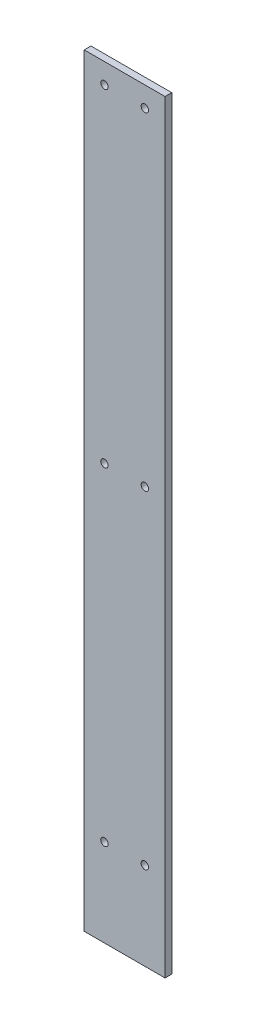
ISO-10303-21;
HEADER;
FILE_DESCRIPTION(('STEP AP214'),'2;1');
FILE_NAME('part.step','',(''),(''),'','','');
FILE_SCHEMA(('AUTOMOTIVE_DESIGN { 1 0 10303 214 1 1 1 1 }'));
ENDSEC;
DATA;
#1=APPLICATION_CONTEXT('core data for automotive mechanical design processes');
#2=APPLICATION_PROTOCOL_DEFINITION('international standard','automotive_design',2000,#1);
#3=PRODUCT_CONTEXT('',#1,'mechanical');
#4=PRODUCT('Part','Part','',(#3));
#5=PRODUCT_RELATED_PRODUCT_CATEGORY('part','',(#4));
#6=PRODUCT_DEFINITION_FORMATION('','',#4);
#7=PRODUCT_DEFINITION_CONTEXT('part definition',#1,'design');
#8=PRODUCT_DEFINITION('design','',#6,#7);
#9=PRODUCT_DEFINITION_SHAPE('','',#8);
#10=(LENGTH_UNIT() NAMED_UNIT(*) SI_UNIT(.MILLI.,.METRE.));
#11=(NAMED_UNIT(*) PLANE_ANGLE_UNIT() SI_UNIT($,.RADIAN.));
#12=(NAMED_UNIT(*) SI_UNIT($,.STERADIAN.) SOLID_ANGLE_UNIT());
#13=UNCERTAINTY_MEASURE_WITH_UNIT(LENGTH_MEASURE(1.E-05),#10,'distance_accuracy_value','');
#14=(GEOMETRIC_REPRESENTATION_CONTEXT(3) GLOBAL_UNCERTAINTY_ASSIGNED_CONTEXT((#13)) GLOBAL_UNIT_ASSIGNED_CONTEXT((#10,
#11,#12)) REPRESENTATION_CONTEXT('',''));
#15=CARTESIAN_POINT('',(0.,0.,0.));
#16=DIRECTION('',(0.,0.,1.));
#17=DIRECTION('',(1.,0.,0.));
#18=AXIS2_PLACEMENT_3D('',#15,#16,#17);
#19=CARTESIAN_POINT('',(0.,0.,5.));
#20=DIRECTION('',(0.,0.,-1.));
#21=DIRECTION('',(-1.,0.,0.));
#22=AXIS2_PLACEMENT_3D('',#19,#20,#21);
#23=PLANE('',#22);
#24=DIRECTION('',(0.,-1.,0.));
#25=VECTOR('',#24,1.);
#26=CARTESIAN_POINT('',(0.,0.,5.));
#27=LINE('',#26,#25);
#28=CARTESIAN_POINT('',(0.,567.,5.));
#29=VERTEX_POINT('',#28);
#30=CARTESIAN_POINT('',(0.,0.,5.));
#31=VERTEX_POINT('',#30);
#32=EDGE_CURVE('E88',#29,#31,#27,.T.);
#33=ORIENTED_EDGE('',*,*,#32,.T.);
#34=DIRECTION('',(1.,0.,0.));
#35=VECTOR('',#34,1.);
#36=CARTESIAN_POINT('',(0.,0.,5.));
#37=LINE('',#36,#35);
#38=CARTESIAN_POINT('',(60.,0.,5.));
#39=VERTEX_POINT('',#38);
#40=EDGE_CURVE('E83',#31,#39,#37,.T.);
#41=ORIENTED_EDGE('',*,*,#40,.T.);
#42=DIRECTION('',(0.,1.,0.));
#43=VECTOR('',#42,1.);
#44=CARTESIAN_POINT('',(60.,0.,5.));
#45=LINE('',#44,#43);
#46=CARTESIAN_POINT('',(60.,567.,5.));
#47=VERTEX_POINT('',#46);
#48=EDGE_CURVE('E86',#39,#47,#45,.T.);
#49=ORIENTED_EDGE('',*,*,#48,.T.);
#50=DIRECTION('',(-1.,0.,0.));
#51=VECTOR('',#50,1.);
#52=CARTESIAN_POINT('',(0.,567.,5.));
#53=LINE('',#52,#51);
#54=EDGE_CURVE('E53',#47,#29,#53,.T.);
#55=ORIENTED_EDGE('',*,*,#54,.T.);
#56=EDGE_LOOP('',(#33,#41,#49,#55));
#57=FACE_BOUND('',#56,.T.);
#58=CARTESIAN_POINT('',(15.,552.,5.));
#59=DIRECTION('',(0.,0.,1.));
#60=DIRECTION('',(1.,0.,0.));
#61=AXIS2_PLACEMENT_3D('',#58,#59,#60);
#62=CIRCLE('',#61,2.74999999999998);
#63=CARTESIAN_POINT('',(17.75,552.,5.));
#64=VERTEX_POINT('',#63);
#65=EDGE_CURVE('E103',#64,#64,#62,.T.);
#66=ORIENTED_EDGE('',*,*,#65,.F.);
#67=EDGE_LOOP('',(#66));
#68=FACE_BOUND('',#67,.T.);
#69=CARTESIAN_POINT('',(45.,552.,5.));
#70=DIRECTION('',(0.,0.,1.));
#71=DIRECTION('',(1.,0.,0.));
#72=AXIS2_PLACEMENT_3D('',#69,#70,#71);
#73=CIRCLE('',#72,2.74999999999999);
#74=CARTESIAN_POINT('',(47.75,552.,5.));
#75=VERTEX_POINT('',#74);
#76=EDGE_CURVE('E118',#75,#75,#73,.T.);
#77=ORIENTED_EDGE('',*,*,#76,.F.);
#78=EDGE_LOOP('',(#77));
#79=FACE_BOUND('',#78,.T.);
#80=CARTESIAN_POINT('',(45.,308.5,5.));
#81=DIRECTION('',(0.,0.,1.));
#82=DIRECTION('',(1.,0.,0.));
#83=AXIS2_PLACEMENT_3D('',#80,#81,#82);
#84=CIRCLE('',#83,2.75);
#85=CARTESIAN_POINT('',(47.75,308.5,5.));
#86=VERTEX_POINT('',#85);
#87=EDGE_CURVE('E124',#86,#86,#84,.T.);
#88=ORIENTED_EDGE('',*,*,#87,.F.);
#89=EDGE_LOOP('',(#88));
#90=FACE_BOUND('',#89,.T.);
#91=CARTESIAN_POINT('',(15.,308.5,5.));
#92=DIRECTION('',(0.,0.,1.));
#93=DIRECTION('',(1.,0.,0.));
#94=AXIS2_PLACEMENT_3D('',#91,#92,#93);
#95=CIRCLE('',#94,2.75);
#96=CARTESIAN_POINT('',(17.75,308.5,5.));
#97=VERTEX_POINT('',#96);
#98=EDGE_CURVE('E130',#97,#97,#95,.T.);
#99=ORIENTED_EDGE('',*,*,#98,.F.);
#100=EDGE_LOOP('',(#99));
#101=FACE_BOUND('',#100,.T.);
#102=CARTESIAN_POINT('',(45.0000000000001,64.9999999999999,5.));
#103=DIRECTION('',(0.,0.,1.));
#104=DIRECTION('',(1.,0.,0.));
#105=AXIS2_PLACEMENT_3D('',#102,#103,#104);
#106=CIRCLE('',#105,2.75);
#107=CARTESIAN_POINT('',(47.7500000000001,64.9999999999999,5.));
#108=VERTEX_POINT('',#107);
#109=EDGE_CURVE('E136',#108,#108,#106,.T.);
#110=ORIENTED_EDGE('',*,*,#109,.F.);
#111=EDGE_LOOP('',(#110));
#112=FACE_BOUND('',#111,.T.);
#113=CARTESIAN_POINT('',(15.0000000000001,64.9999999999999,5.));
#114=DIRECTION('',(0.,0.,1.));
#115=DIRECTION('',(1.,0.,0.));
#116=AXIS2_PLACEMENT_3D('',#113,#114,#115);
#117=CIRCLE('',#116,2.75);
#118=CARTESIAN_POINT('',(17.7500000000001,64.9999999999999,5.));
#119=VERTEX_POINT('',#118);
#120=EDGE_CURVE('E142',#119,#119,#117,.T.);
#121=ORIENTED_EDGE('',*,*,#120,.F.);
#122=EDGE_LOOP('',(#121));
#123=FACE_BOUND('',#122,.T.);
#124=ADVANCED_FACE('F36',(#57,#68,#79,#90,#101,#112,#123),#23,.F.);
#125=CARTESIAN_POINT('',(0.,0.,0.));
#126=DIRECTION('',(0.,0.,-1.));
#127=DIRECTION('',(-1.,0.,0.));
#128=AXIS2_PLACEMENT_3D('',#125,#126,#127);
#129=PLANE('',#128);
#130=CARTESIAN_POINT('',(45.0000000000001,64.9999999999999,0.));
#131=DIRECTION('',(0.,0.,1.));
#132=DIRECTION('',(1.,0.,0.));
#133=AXIS2_PLACEMENT_3D('',#130,#131,#132);
#134=CIRCLE('',#133,2.75);
#135=CARTESIAN_POINT('',(47.7500000000001,64.9999999999999,0.));
#136=VERTEX_POINT('',#135);
#137=EDGE_CURVE('E139',#136,#136,#134,.T.);
#138=ORIENTED_EDGE('',*,*,#137,.T.);
#139=EDGE_LOOP('',(#138));
#140=FACE_BOUND('',#139,.T.);
#141=CARTESIAN_POINT('',(45.,308.5,0.));
#142=DIRECTION('',(0.,0.,1.));
#143=DIRECTION('',(1.,0.,0.));
#144=AXIS2_PLACEMENT_3D('',#141,#142,#143);
#145=CIRCLE('',#144,2.75);
#146=CARTESIAN_POINT('',(47.75,308.5,0.));
#147=VERTEX_POINT('',#146);
#148=EDGE_CURVE('E127',#147,#147,#145,.T.);
#149=ORIENTED_EDGE('',*,*,#148,.T.);
#150=EDGE_LOOP('',(#149));
#151=FACE_BOUND('',#150,.T.);
#152=CARTESIAN_POINT('',(15.,552.,0.));
#153=DIRECTION('',(0.,0.,1.));
#154=DIRECTION('',(1.,0.,0.));
#155=AXIS2_PLACEMENT_3D('',#152,#153,#154);
#156=CIRCLE('',#155,2.74999999999998);
#157=CARTESIAN_POINT('',(17.75,552.,0.));
#158=VERTEX_POINT('',#157);
#159=EDGE_CURVE('E115',#158,#158,#156,.T.);
#160=ORIENTED_EDGE('',*,*,#159,.T.);
#161=EDGE_LOOP('',(#160));
#162=FACE_BOUND('',#161,.T.);
#163=DIRECTION('',(0.,-1.,0.));
#164=VECTOR('',#163,1.);
#165=CARTESIAN_POINT('',(0.,0.,0.));
#166=LINE('',#165,#164);
#167=CARTESIAN_POINT('',(0.,567.,0.));
#168=VERTEX_POINT('',#167);
#169=CARTESIAN_POINT('',(0.,0.,0.));
#170=VERTEX_POINT('',#169);
#171=EDGE_CURVE('E100',#168,#170,#166,.T.);
#172=ORIENTED_EDGE('',*,*,#171,.F.);
#173=DIRECTION('',(-1.,0.,0.));
#174=VECTOR('',#173,1.);
#175=CARTESIAN_POINT('',(0.,567.,0.));
#176=LINE('',#175,#174);
#177=CARTESIAN_POINT('',(60.,567.,0.));
#178=VERTEX_POINT('',#177);
#179=EDGE_CURVE('E76',#178,#168,#176,.T.);
#180=ORIENTED_EDGE('',*,*,#179,.F.);
#181=DIRECTION('',(0.,1.,0.));
#182=VECTOR('',#181,1.);
#183=CARTESIAN_POINT('',(60.,0.,0.));
#184=LINE('',#183,#182);
#185=CARTESIAN_POINT('',(60.,0.,0.));
#186=VERTEX_POINT('',#185);
#187=EDGE_CURVE('E70',#186,#178,#184,.T.);
#188=ORIENTED_EDGE('',*,*,#187,.F.);
#189=DIRECTION('',(1.,0.,0.));
#190=VECTOR('',#189,1.);
#191=CARTESIAN_POINT('',(0.,0.,0.));
#192=LINE('',#191,#190);
#193=EDGE_CURVE('E92',#170,#186,#192,.T.);
#194=ORIENTED_EDGE('',*,*,#193,.F.);
#195=EDGE_LOOP('',(#172,#180,#188,#194));
#196=FACE_BOUND('',#195,.T.);
#197=CARTESIAN_POINT('',(45.,552.,0.));
#198=DIRECTION('',(0.,0.,1.));
#199=DIRECTION('',(1.,0.,0.));
#200=AXIS2_PLACEMENT_3D('',#197,#198,#199);
#201=CIRCLE('',#200,2.74999999999999);
#202=CARTESIAN_POINT('',(47.75,552.,0.));
#203=VERTEX_POINT('',#202);
#204=EDGE_CURVE('E121',#203,#203,#201,.T.);
#205=ORIENTED_EDGE('',*,*,#204,.T.);
#206=EDGE_LOOP('',(#205));
#207=FACE_BOUND('',#206,.T.);
#208=CARTESIAN_POINT('',(15.,308.5,0.));
#209=DIRECTION('',(0.,0.,1.));
#210=DIRECTION('',(1.,0.,0.));
#211=AXIS2_PLACEMENT_3D('',#208,#209,#210);
#212=CIRCLE('',#211,2.75);
#213=CARTESIAN_POINT('',(17.75,308.5,0.));
#214=VERTEX_POINT('',#213);
#215=EDGE_CURVE('E133',#214,#214,#212,.T.);
#216=ORIENTED_EDGE('',*,*,#215,.T.);
#217=EDGE_LOOP('',(#216));
#218=FACE_BOUND('',#217,.T.);
#219=CARTESIAN_POINT('',(15.0000000000001,64.9999999999999,0.));
#220=DIRECTION('',(0.,0.,1.));
#221=DIRECTION('',(1.,0.,0.));
#222=AXIS2_PLACEMENT_3D('',#219,#220,#221);
#223=CIRCLE('',#222,2.75);
#224=CARTESIAN_POINT('',(17.7500000000001,64.9999999999999,0.));
#225=VERTEX_POINT('',#224);
#226=EDGE_CURVE('E145',#225,#225,#223,.T.);
#227=ORIENTED_EDGE('',*,*,#226,.T.);
#228=EDGE_LOOP('',(#227));
#229=FACE_BOUND('',#228,.T.);
#230=ADVANCED_FACE('F111',(#140,#151,#162,#196,#207,#218,#229),#129,.T.);
#231=CARTESIAN_POINT('',(0.,0.,5.));
#232=DIRECTION('',(1.,0.,0.));
#233=DIRECTION('',(0.,0.,-1.));
#234=AXIS2_PLACEMENT_3D('',#231,#232,#233);
#235=PLANE('',#234);
#236=ORIENTED_EDGE('',*,*,#171,.T.);
#237=DIRECTION('',(0.,0.,-1.));
#238=VECTOR('',#237,1.);
#239=CARTESIAN_POINT('',(0.,0.,5.));
#240=LINE('',#239,#238);
#241=EDGE_CURVE('E11',#31,#170,#240,.T.);
#242=ORIENTED_EDGE('',*,*,#241,.F.);
#243=ORIENTED_EDGE('',*,*,#32,.F.);
#244=DIRECTION('',(0.,0.,-1.));
#245=VECTOR('',#244,1.);
#246=CARTESIAN_POINT('',(0.,567.,5.));
#247=LINE('',#246,#245);
#248=EDGE_CURVE('E96',#29,#168,#247,.T.);
#249=ORIENTED_EDGE('',*,*,#248,.T.);
#250=EDGE_LOOP('',(#236,#242,#243,#249));
#251=FACE_BOUND('',#250,.T.);
#252=ADVANCED_FACE('F38',(#251),#235,.F.);
#253=CARTESIAN_POINT('',(0.,0.,5.));
#254=DIRECTION('',(0.,1.,0.));
#255=DIRECTION('',(0.,0.,1.));
#256=AXIS2_PLACEMENT_3D('',#253,#254,#255);
#257=PLANE('',#256);
#258=ORIENTED_EDGE('',*,*,#193,.T.);
#259=DIRECTION('',(0.,0.,-1.));
#260=VECTOR('',#259,1.);
#261=CARTESIAN_POINT('',(60.,0.,5.));
#262=LINE('',#261,#260);
#263=EDGE_CURVE('E45',#39,#186,#262,.T.);
#264=ORIENTED_EDGE('',*,*,#263,.F.);
#265=ORIENTED_EDGE('',*,*,#40,.F.);
#266=ORIENTED_EDGE('',*,*,#241,.T.);
#267=EDGE_LOOP('',(#258,#264,#265,#266));
#268=FACE_BOUND('',#267,.T.);
#269=ADVANCED_FACE('F91',(#268),#257,.F.);
#270=CARTESIAN_POINT('',(60.,0.,5.));
#271=DIRECTION('',(-1.,0.,0.));
#272=DIRECTION('',(0.,0.,1.));
#273=AXIS2_PLACEMENT_3D('',#270,#271,#272);
#274=PLANE('',#273);
#275=ORIENTED_EDGE('',*,*,#187,.T.);
#276=DIRECTION('',(0.,0.,-1.));
#277=VECTOR('',#276,1.);
#278=CARTESIAN_POINT('',(60.,567.,5.));
#279=LINE('',#278,#277);
#280=EDGE_CURVE('E93',#47,#178,#279,.T.);
#281=ORIENTED_EDGE('',*,*,#280,.F.);
#282=ORIENTED_EDGE('',*,*,#48,.F.);
#283=ORIENTED_EDGE('',*,*,#263,.T.);
#284=EDGE_LOOP('',(#275,#281,#282,#283));
#285=FACE_BOUND('',#284,.T.);
#286=ADVANCED_FACE('F94',(#285),#274,.F.);
#287=CARTESIAN_POINT('',(0.,567.,5.));
#288=DIRECTION('',(0.,-1.,0.));
#289=DIRECTION('',(0.,0.,-1.));
#290=AXIS2_PLACEMENT_3D('',#287,#288,#289);
#291=PLANE('',#290);
#292=ORIENTED_EDGE('',*,*,#179,.T.);
#293=ORIENTED_EDGE('',*,*,#248,.F.);
#294=ORIENTED_EDGE('',*,*,#54,.F.);
#295=ORIENTED_EDGE('',*,*,#280,.T.);
#296=EDGE_LOOP('',(#292,#293,#294,#295));
#297=FACE_BOUND('',#296,.T.);
#298=ADVANCED_FACE('F108',(#297),#291,.F.);
#299=CARTESIAN_POINT('',(15.,552.,5.));
#300=DIRECTION('',(0.,0.,-1.));
#301=DIRECTION('',(-1.,0.,0.));
#302=AXIS2_PLACEMENT_3D('',#299,#300,#301);
#303=CYLINDRICAL_SURFACE('',#302,2.74999999999998);
#304=ORIENTED_EDGE('',*,*,#65,.T.);
#305=EDGE_LOOP('',(#304));
#306=FACE_BOUND('',#305,.T.);
#307=ORIENTED_EDGE('',*,*,#159,.F.);
#308=EDGE_LOOP('',(#307));
#309=FACE_BOUND('',#308,.T.);
#310=ADVANCED_FACE('F162',(#306,#309),#303,.F.);
#311=CARTESIAN_POINT('',(45.,552.,5.));
#312=DIRECTION('',(0.,0.,-1.));
#313=DIRECTION('',(-1.,0.,0.));
#314=AXIS2_PLACEMENT_3D('',#311,#312,#313);
#315=CYLINDRICAL_SURFACE('',#314,2.74999999999999);
#316=ORIENTED_EDGE('',*,*,#76,.T.);
#317=EDGE_LOOP('',(#316));
#318=FACE_BOUND('',#317,.T.);
#319=ORIENTED_EDGE('',*,*,#204,.F.);
#320=EDGE_LOOP('',(#319));
#321=FACE_BOUND('',#320,.T.);
#322=ADVANCED_FACE('F208',(#318,#321),#315,.F.);
#323=CARTESIAN_POINT('',(45.,308.5,5.));
#324=DIRECTION('',(0.,0.,-1.));
#325=DIRECTION('',(-1.,0.,0.));
#326=AXIS2_PLACEMENT_3D('',#323,#324,#325);
#327=CYLINDRICAL_SURFACE('',#326,2.75);
#328=ORIENTED_EDGE('',*,*,#87,.T.);
#329=EDGE_LOOP('',(#328));
#330=FACE_BOUND('',#329,.T.);
#331=ORIENTED_EDGE('',*,*,#148,.F.);
#332=EDGE_LOOP('',(#331));
#333=FACE_BOUND('',#332,.T.);
#334=ADVANCED_FACE('F216',(#330,#333),#327,.F.);
#335=CARTESIAN_POINT('',(15.,308.5,5.));
#336=DIRECTION('',(0.,0.,-1.));
#337=DIRECTION('',(-1.,0.,0.));
#338=AXIS2_PLACEMENT_3D('',#335,#336,#337);
#339=CYLINDRICAL_SURFACE('',#338,2.75);
#340=ORIENTED_EDGE('',*,*,#98,.T.);
#341=EDGE_LOOP('',(#340));
#342=FACE_BOUND('',#341,.T.);
#343=ORIENTED_EDGE('',*,*,#215,.F.);
#344=EDGE_LOOP('',(#343));
#345=FACE_BOUND('',#344,.T.);
#346=ADVANCED_FACE('F224',(#342,#345),#339,.F.);
#347=CARTESIAN_POINT('',(45.0000000000001,64.9999999999999,5.));
#348=DIRECTION('',(0.,0.,-1.));
#349=DIRECTION('',(-1.,0.,0.));
#350=AXIS2_PLACEMENT_3D('',#347,#348,#349);
#351=CYLINDRICAL_SURFACE('',#350,2.75);
#352=ORIENTED_EDGE('',*,*,#109,.T.);
#353=EDGE_LOOP('',(#352));
#354=FACE_BOUND('',#353,.T.);
#355=ORIENTED_EDGE('',*,*,#137,.F.);
#356=EDGE_LOOP('',(#355));
#357=FACE_BOUND('',#356,.T.);
#358=ADVANCED_FACE('F233',(#354,#357),#351,.F.);
#359=CARTESIAN_POINT('',(15.0000000000001,64.9999999999999,5.));
#360=DIRECTION('',(0.,0.,-1.));
#361=DIRECTION('',(-1.,0.,0.));
#362=AXIS2_PLACEMENT_3D('',#359,#360,#361);
#363=CYLINDRICAL_SURFACE('',#362,2.75);
#364=ORIENTED_EDGE('',*,*,#120,.T.);
#365=EDGE_LOOP('',(#364));
#366=FACE_BOUND('',#365,.T.);
#367=ORIENTED_EDGE('',*,*,#226,.F.);
#368=EDGE_LOOP('',(#367));
#369=FACE_BOUND('',#368,.T.);
#370=ADVANCED_FACE('F151',(#366,#369),#363,.F.);
#371=CLOSED_SHELL('',(#124,#230,#252,#269,#286,#298,#310,#322,#334,#346,#358,#370));
#372=MANIFOLD_SOLID_BREP('B2',#371);
#373=ADVANCED_BREP_SHAPE_REPRESENTATION('',(#18,#372),#14);
#374=SHAPE_DEFINITION_REPRESENTATION(#9,#373);
ENDSEC;
END-ISO-10303-21;
